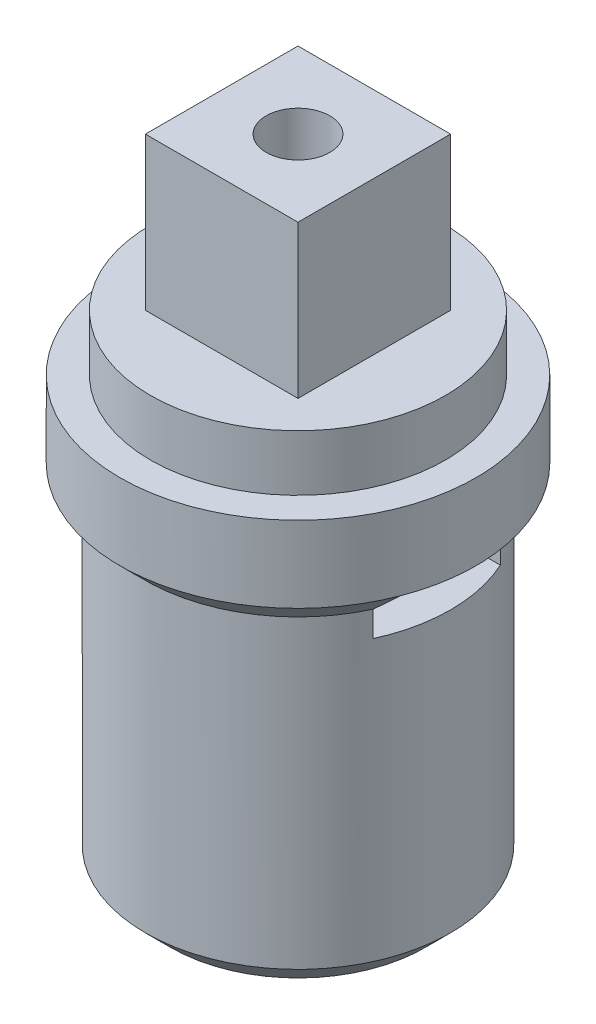
ISO-10303-21;
HEADER;
FILE_DESCRIPTION(('STEP AP214'),'2;1');
FILE_NAME('part.step','',(''),(''),'','','');
FILE_SCHEMA(('AUTOMOTIVE_DESIGN { 1 0 10303 214 1 1 1 1 }'));
ENDSEC;
DATA;
#1=APPLICATION_CONTEXT('core data for automotive mechanical design processes');
#2=APPLICATION_PROTOCOL_DEFINITION('international standard','automotive_design',2000,#1);
#3=PRODUCT_CONTEXT('',#1,'mechanical');
#4=PRODUCT('Part','Part','',(#3));
#5=PRODUCT_RELATED_PRODUCT_CATEGORY('part','',(#4));
#6=PRODUCT_DEFINITION_FORMATION('','',#4);
#7=PRODUCT_DEFINITION_CONTEXT('part definition',#1,'design');
#8=PRODUCT_DEFINITION('design','',#6,#7);
#9=PRODUCT_DEFINITION_SHAPE('','',#8);
#10=(LENGTH_UNIT() NAMED_UNIT(*) SI_UNIT(.MILLI.,.METRE.));
#11=(NAMED_UNIT(*) PLANE_ANGLE_UNIT() SI_UNIT($,.RADIAN.));
#12=(NAMED_UNIT(*) SI_UNIT($,.STERADIAN.) SOLID_ANGLE_UNIT());
#13=UNCERTAINTY_MEASURE_WITH_UNIT(LENGTH_MEASURE(1.E-05),#10,'distance_accuracy_value','');
#14=(GEOMETRIC_REPRESENTATION_CONTEXT(3) GLOBAL_UNCERTAINTY_ASSIGNED_CONTEXT((#13)) GLOBAL_UNIT_ASSIGNED_CONTEXT((#10,
#11,#12)) REPRESENTATION_CONTEXT('',''));
#15=CARTESIAN_POINT('',(0.,0.,0.));
#16=DIRECTION('',(0.,0.,1.));
#17=DIRECTION('',(1.,0.,0.));
#18=AXIS2_PLACEMENT_3D('',#15,#16,#17);
#19=CARTESIAN_POINT('',(0.,19.2,0.));
#20=DIRECTION('',(0.,1.,0.));
#21=DIRECTION('',(0.,0.,1.));
#22=AXIS2_PLACEMENT_3D('',#19,#20,#21);
#23=PLANE('',#22);
#24=CARTESIAN_POINT('',(0.,19.2,0.));
#25=DIRECTION('',(0.,1.,0.));
#26=DIRECTION('',(0.,0.,1.));
#27=AXIS2_PLACEMENT_3D('',#24,#25,#26);
#28=CIRCLE('',#27,5.8);
#29=CARTESIAN_POINT('',(0.,19.2,5.8));
#30=VERTEX_POINT('',#29);
#31=EDGE_CURVE('E173',#30,#30,#28,.T.);
#32=ORIENTED_EDGE('',*,*,#31,.T.);
#33=EDGE_LOOP('',(#32));
#34=FACE_BOUND('',#33,.T.);
#35=DIRECTION('',(-1.,0.,0.));
#36=VECTOR('',#35,1.);
#37=CARTESIAN_POINT('',(-3.,19.2,-3.));
#38=LINE('',#37,#36);
#39=CARTESIAN_POINT('',(3.,19.2,-3.));
#40=VERTEX_POINT('',#39);
#41=CARTESIAN_POINT('',(-3.,19.2,-3.));
#42=VERTEX_POINT('',#41);
#43=EDGE_CURVE('E585',#40,#42,#38,.T.);
#44=ORIENTED_EDGE('',*,*,#43,.F.);
#45=DIRECTION('',(0.,0.,-1.));
#46=VECTOR('',#45,1.);
#47=CARTESIAN_POINT('',(3.,19.2,-3.));
#48=LINE('',#47,#46);
#49=CARTESIAN_POINT('',(3.,19.2,3.));
#50=VERTEX_POINT('',#49);
#51=EDGE_CURVE('E161',#50,#40,#48,.T.);
#52=ORIENTED_EDGE('',*,*,#51,.F.);
#53=DIRECTION('',(1.,0.,0.));
#54=VECTOR('',#53,1.);
#55=CARTESIAN_POINT('',(-3.,19.2,3.));
#56=LINE('',#55,#54);
#57=CARTESIAN_POINT('',(-3.,19.2,3.));
#58=VERTEX_POINT('',#57);
#59=EDGE_CURVE('E157',#58,#50,#56,.T.);
#60=ORIENTED_EDGE('',*,*,#59,.F.);
#61=DIRECTION('',(0.,0.,1.));
#62=VECTOR('',#61,1.);
#63=CARTESIAN_POINT('',(-3.,19.2,-3.));
#64=LINE('',#63,#62);
#65=EDGE_CURVE('E582',#42,#58,#64,.T.);
#66=ORIENTED_EDGE('',*,*,#65,.F.);
#67=EDGE_LOOP('',(#44,#52,#60,#66));
#68=FACE_BOUND('',#67,.T.);
#69=ADVANCED_FACE('F36',(#34,#68),#23,.T.);
#70=CARTESIAN_POINT('',(0.,12.,0.));
#71=DIRECTION('',(0.,1.,0.));
#72=DIRECTION('',(0.,0.,1.));
#73=AXIS2_PLACEMENT_3D('',#70,#71,#72);
#74=PLANE('',#73);
#75=CARTESIAN_POINT('',(0.,12.,0.));
#76=DIRECTION('',(0.,1.,0.));
#77=DIRECTION('',(0.,0.,1.));
#78=AXIS2_PLACEMENT_3D('',#75,#76,#77);
#79=CIRCLE('',#78,1.5);
#80=CARTESIAN_POINT('',(0.,12.,1.5));
#81=VERTEX_POINT('',#80);
#82=EDGE_CURVE('E210',#81,#81,#79,.T.);
#83=ORIENTED_EDGE('',*,*,#82,.F.);
#84=EDGE_LOOP('',(#83));
#85=FACE_BOUND('',#84,.T.);
#86=CARTESIAN_POINT('',(0.,12.,0.));
#87=DIRECTION('',(0.,1.,0.));
#88=DIRECTION('',(0.,0.,1.));
#89=AXIS2_PLACEMENT_3D('',#86,#87,#88);
#90=CIRCLE('',#89,6.);
#91=CARTESIAN_POINT('',(-5.45435605731786,12.,-2.5));
#92=VERTEX_POINT('',#91);
#93=CARTESIAN_POINT('',(-5.45435605731786,12.,2.5));
#94=VERTEX_POINT('',#93);
#95=EDGE_CURVE('E219',#92,#94,#90,.T.);
#96=ORIENTED_EDGE('',*,*,#95,.T.);
#97=DIRECTION('',(-1.,0.,0.));
#98=VECTOR('',#97,1.);
#99=CARTESIAN_POINT('',(5.45435605731786,12.,2.5));
#100=LINE('',#99,#98);
#101=CARTESIAN_POINT('',(5.45435605731786,12.,2.5));
#102=VERTEX_POINT('',#101);
#103=EDGE_CURVE('E186',#102,#94,#100,.T.);
#104=ORIENTED_EDGE('',*,*,#103,.F.);
#105=CARTESIAN_POINT('',(5.45435605731786,12.,-2.5));
#106=VERTEX_POINT('',#105);
#107=EDGE_CURVE('E214',#102,#106,#90,.T.);
#108=ORIENTED_EDGE('',*,*,#107,.T.);
#109=DIRECTION('',(1.,0.,0.));
#110=VECTOR('',#109,1.);
#111=CARTESIAN_POINT('',(5.45435605731786,12.,-2.5));
#112=LINE('',#111,#110);
#113=EDGE_CURVE('E200',#92,#106,#112,.T.);
#114=ORIENTED_EDGE('',*,*,#113,.F.);
#115=EDGE_LOOP('',(#96,#104,#108,#114));
#116=FACE_BOUND('',#115,.T.);
#117=ADVANCED_FACE('F283',(#85,#116),#74,.T.);
#118=CARTESIAN_POINT('',(0.,9.,0.));
#119=DIRECTION('',(0.,-1.,0.));
#120=DIRECTION('',(0.,0.,-1.));
#121=AXIS2_PLACEMENT_3D('',#118,#119,#120);
#122=CYLINDRICAL_SURFACE('',#121,6.);
#123=CARTESIAN_POINT('',(0.,0.999999999999999,0.));
#124=DIRECTION('',(0.,1.,0.));
#125=DIRECTION('',(0.,0.,1.));
#126=AXIS2_PLACEMENT_3D('',#123,#124,#125);
#127=CIRCLE('',#126,6.);
#128=CARTESIAN_POINT('',(0.,0.999999999999999,6.));
#129=VERTEX_POINT('',#128);
#130=EDGE_CURVE('E247',#129,#129,#127,.T.);
#131=ORIENTED_EDGE('',*,*,#130,.T.);
#132=EDGE_LOOP('',(#131));
#133=FACE_BOUND('',#132,.T.);
#134=DIRECTION('',(0.,-1.,0.));
#135=VECTOR('',#134,1.);
#136=CARTESIAN_POINT('',(5.45435605731786,14.,2.5));
#137=LINE('',#136,#135);
#138=CARTESIAN_POINT('',(5.45435605731786,13.,2.5));
#139=VERTEX_POINT('',#138);
#140=EDGE_CURVE('E198',#139,#102,#137,.T.);
#141=ORIENTED_EDGE('',*,*,#140,.F.);
#142=CARTESIAN_POINT('',(0.,13.,0.));
#143=DIRECTION('',(0.,1.,0.));
#144=DIRECTION('',(0.,0.,1.));
#145=AXIS2_PLACEMENT_3D('',#142,#143,#144);
#146=CIRCLE('',#145,6.);
#147=CARTESIAN_POINT('',(-5.45435605731786,13.,2.5));
#148=VERTEX_POINT('',#147);
#149=EDGE_CURVE('E244',#139,#148,#146,.F.);
#150=ORIENTED_EDGE('',*,*,#149,.T.);
#151=DIRECTION('',(0.,-1.,0.));
#152=VECTOR('',#151,1.);
#153=CARTESIAN_POINT('',(-5.45435605731786,14.,2.5));
#154=LINE('',#153,#152);
#155=EDGE_CURVE('E193',#148,#94,#154,.T.);
#156=ORIENTED_EDGE('',*,*,#155,.T.);
#157=ORIENTED_EDGE('',*,*,#95,.F.);
#158=DIRECTION('',(0.,-1.,0.));
#159=VECTOR('',#158,1.);
#160=CARTESIAN_POINT('',(-5.45435605731786,14.,-2.5));
#161=LINE('',#160,#159);
#162=CARTESIAN_POINT('',(-5.45435605731786,13.,-2.5));
#163=VERTEX_POINT('',#162);
#164=EDGE_CURVE('E208',#163,#92,#161,.T.);
#165=ORIENTED_EDGE('',*,*,#164,.F.);
#166=CARTESIAN_POINT('',(0.,13.,0.));
#167=DIRECTION('',(0.,1.,0.));
#168=DIRECTION('',(0.,0.,1.));
#169=AXIS2_PLACEMENT_3D('',#166,#167,#168);
#170=CIRCLE('',#169,6.);
#171=CARTESIAN_POINT('',(5.45435605731786,13.,-2.5));
#172=VERTEX_POINT('',#171);
#173=EDGE_CURVE('E180',#163,#172,#170,.F.);
#174=ORIENTED_EDGE('',*,*,#173,.T.);
#175=DIRECTION('',(0.,-1.,0.));
#176=VECTOR('',#175,1.);
#177=CARTESIAN_POINT('',(5.45435605731786,14.,-2.5));
#178=LINE('',#177,#176);
#179=EDGE_CURVE('E203',#172,#106,#178,.T.);
#180=ORIENTED_EDGE('',*,*,#179,.T.);
#181=ORIENTED_EDGE('',*,*,#107,.F.);
#182=EDGE_LOOP('',(#141,#150,#156,#157,#165,#174,#180,#181));
#183=FACE_BOUND('',#182,.T.);
#184=ADVANCED_FACE('F279',(#133,#183),#122,.T.);
#185=CARTESIAN_POINT('',(0.,0.,0.));
#186=DIRECTION('',(0.,1.,0.));
#187=DIRECTION('',(0.,0.,1.));
#188=AXIS2_PLACEMENT_3D('',#185,#186,#187);
#189=PLANE('',#188);
#190=CARTESIAN_POINT('',(0.,0.,0.));
#191=DIRECTION('',(0.,1.,0.));
#192=DIRECTION('',(0.,0.,1.));
#193=AXIS2_PLACEMENT_3D('',#190,#191,#192);
#194=CIRCLE('',#193,5.);
#195=CARTESIAN_POINT('',(0.,0.,5.));
#196=VERTEX_POINT('',#195);
#197=EDGE_CURVE('E251',#196,#196,#194,.F.);
#198=ORIENTED_EDGE('',*,*,#197,.T.);
#199=EDGE_LOOP('',(#198));
#200=FACE_BOUND('',#199,.T.);
#201=DIRECTION('',(0.,0.,1.));
#202=VECTOR('',#201,1.);
#203=CARTESIAN_POINT('',(-1.28,0.,-1.40413674547745));
#204=LINE('',#203,#202);
#205=CARTESIAN_POINT('',(-1.28,0.,-1.40413674547745));
#206=VERTEX_POINT('',#205);
#207=CARTESIAN_POINT('',(-1.28,0.,1.40413674547745));
#208=VERTEX_POINT('',#207);
#209=EDGE_CURVE('E227',#206,#208,#204,.T.);
#210=ORIENTED_EDGE('',*,*,#209,.T.);
#211=CARTESIAN_POINT('',(0.,0.,0.));
#212=DIRECTION('',(0.,1.,0.));
#213=DIRECTION('',(0.,0.,1.));
#214=AXIS2_PLACEMENT_3D('',#211,#212,#213);
#215=CIRCLE('',#214,1.9);
#216=EDGE_CURVE('E223',#208,#206,#215,.T.);
#217=ORIENTED_EDGE('',*,*,#216,.T.);
#218=EDGE_LOOP('',(#210,#217));
#219=FACE_BOUND('',#218,.T.);
#220=ADVANCED_FACE('F282',(#200,#219),#189,.F.);
#221=CARTESIAN_POINT('',(0.,0.,0.));
#222=DIRECTION('',(0.,1.,0.));
#223=DIRECTION('',(0.,0.,1.));
#224=AXIS2_PLACEMENT_3D('',#221,#222,#223);
#225=CYLINDRICAL_SURFACE('',#224,1.9);
#226=CARTESIAN_POINT('',(0.,9.,0.));
#227=DIRECTION('',(0.,1.,0.));
#228=DIRECTION('',(0.,0.,1.));
#229=AXIS2_PLACEMENT_3D('',#226,#227,#228);
#230=CIRCLE('',#229,1.9);
#231=CARTESIAN_POINT('',(-1.28,9.,1.40413674547745));
#232=VERTEX_POINT('',#231);
#233=CARTESIAN_POINT('',(-1.28,9.,-1.40413674547745));
#234=VERTEX_POINT('',#233);
#235=EDGE_CURVE('E222',#232,#234,#230,.T.);
#236=ORIENTED_EDGE('',*,*,#235,.T.);
#237=DIRECTION('',(0.,1.,0.));
#238=VECTOR('',#237,1.);
#239=CARTESIAN_POINT('',(-1.28,0.,-1.40413674547745));
#240=LINE('',#239,#238);
#241=EDGE_CURVE('E231',#206,#234,#240,.T.);
#242=ORIENTED_EDGE('',*,*,#241,.F.);
#243=ORIENTED_EDGE('',*,*,#216,.F.);
#244=DIRECTION('',(0.,1.,0.));
#245=VECTOR('',#244,1.);
#246=CARTESIAN_POINT('',(-1.28,0.,1.40413674547745));
#247=LINE('',#246,#245);
#248=EDGE_CURVE('E181',#208,#232,#247,.T.);
#249=ORIENTED_EDGE('',*,*,#248,.T.);
#250=EDGE_LOOP('',(#236,#242,#243,#249));
#251=FACE_BOUND('',#250,.T.);
#252=ADVANCED_FACE('F287',(#251),#225,.F.);
#253=CARTESIAN_POINT('',(-1.28,0.,-1.40413674547745));
#254=DIRECTION('',(-1.,0.,0.));
#255=DIRECTION('',(0.,0.,1.));
#256=AXIS2_PLACEMENT_3D('',#253,#254,#255);
#257=PLANE('',#256);
#258=DIRECTION('',(0.,0.,1.));
#259=VECTOR('',#258,1.);
#260=CARTESIAN_POINT('',(-1.28,9.,-1.40413674547745));
#261=LINE('',#260,#259);
#262=CARTESIAN_POINT('',(-1.28,9.,-0.782048591840687));
#263=VERTEX_POINT('',#262);
#264=EDGE_CURVE('E228',#234,#263,#261,.T.);
#265=ORIENTED_EDGE('',*,*,#264,.T.);
#266=CARTESIAN_POINT('',(-1.28,9.,0.782048591840687));
#267=VERTEX_POINT('',#266);
#268=EDGE_CURVE('E237',#263,#267,#261,.T.);
#269=ORIENTED_EDGE('',*,*,#268,.T.);
#270=EDGE_CURVE('E234',#267,#232,#261,.T.);
#271=ORIENTED_EDGE('',*,*,#270,.T.);
#272=ORIENTED_EDGE('',*,*,#248,.F.);
#273=ORIENTED_EDGE('',*,*,#209,.F.);
#274=ORIENTED_EDGE('',*,*,#241,.T.);
#275=EDGE_LOOP('',(#265,#269,#271,#272,#273,#274));
#276=FACE_BOUND('',#275,.T.);
#277=ADVANCED_FACE('F291',(#276),#257,.F.);
#278=CARTESIAN_POINT('',(0.,9.,0.));
#279=DIRECTION('',(0.,1.,0.));
#280=DIRECTION('',(0.,0.,1.));
#281=AXIS2_PLACEMENT_3D('',#278,#279,#280);
#282=PLANE('',#281);
#283=ORIENTED_EDGE('',*,*,#270,.F.);
#284=CARTESIAN_POINT('',(0.,9.,0.));
#285=DIRECTION('',(0.,1.,0.));
#286=DIRECTION('',(0.,0.,1.));
#287=AXIS2_PLACEMENT_3D('',#284,#285,#286);
#288=CIRCLE('',#287,1.5);
#289=EDGE_CURVE('E215',#267,#263,#288,.T.);
#290=ORIENTED_EDGE('',*,*,#289,.T.);
#291=ORIENTED_EDGE('',*,*,#264,.F.);
#292=ORIENTED_EDGE('',*,*,#235,.F.);
#293=EDGE_LOOP('',(#283,#290,#291,#292));
#294=FACE_BOUND('',#293,.T.);
#295=ADVANCED_FACE('F295',(#294),#282,.F.);
#296=CARTESIAN_POINT('',(0.,9.,0.));
#297=DIRECTION('',(0.,1.,0.));
#298=DIRECTION('',(0.,0.,1.));
#299=AXIS2_PLACEMENT_3D('',#296,#297,#298);
#300=CYLINDRICAL_SURFACE('',#299,1.5);
#301=EDGE_CURVE('E211',#263,#267,#288,.T.);
#302=ORIENTED_EDGE('',*,*,#301,.F.);
#303=ORIENTED_EDGE('',*,*,#289,.F.);
#304=EDGE_LOOP('',(#302,#303));
#305=FACE_BOUND('',#304,.T.);
#306=ORIENTED_EDGE('',*,*,#82,.T.);
#307=EDGE_LOOP('',(#306));
#308=FACE_BOUND('',#307,.T.);
#309=ADVANCED_FACE('F299',(#305,#308),#300,.F.);
#310=CARTESIAN_POINT('',(0.,9.,0.));
#311=DIRECTION('',(0.,1.,0.));
#312=DIRECTION('',(0.,0.,1.));
#313=AXIS2_PLACEMENT_3D('',#310,#311,#312);
#314=PLANE('',#313);
#315=ORIENTED_EDGE('',*,*,#301,.T.);
#316=ORIENTED_EDGE('',*,*,#268,.F.);
#317=EDGE_LOOP('',(#315,#316));
#318=FACE_BOUND('',#317,.T.);
#319=ADVANCED_FACE('F306',(#318),#314,.T.);
#320=CARTESIAN_POINT('',(5.45435605731786,14.,-2.5));
#321=DIRECTION('',(0.,0.,-1.));
#322=DIRECTION('',(-1.,0.,0.));
#323=AXIS2_PLACEMENT_3D('',#320,#321,#322);
#324=PLANE('',#323);
#325=ORIENTED_EDGE('',*,*,#113,.T.);
#326=ORIENTED_EDGE('',*,*,#179,.F.);
#327=CARTESIAN_POINT('',(5.45435605731786,13.,-2.5));
#328=CARTESIAN_POINT('',(5.54529642140193,13.0826726264298,-2.5));
#329=CARTESIAN_POINT('',(5.63606039872621,13.165538919457,-2.5));
#330=CARTESIAN_POINT('',(5.81727250564772,13.3316141410082,-2.5));
#331=CARTESIAN_POINT('',(5.90772063880026,13.4148230656522,-2.5));
#332=CARTESIAN_POINT('',(6.0883398156715,13.5815405191101,-2.5));
#333=CARTESIAN_POINT('',(6.178510860064,13.6650490471943,-2.5));
#334=CARTESIAN_POINT('',(6.35860694066369,13.8323330229718,-2.5));
#335=CARTESIAN_POINT('',(6.44853197408404,13.9161084736657,-2.5));
#336=CARTESIAN_POINT('',(6.53834841531101,14.,-2.5));
#337=B_SPLINE_CURVE_WITH_KNOTS('',3,(#327,#328,#329,#330,#331,#332,#333,#334,#335,#336),
.UNSPECIFIED.,.F.,.F.,(4,2,2,2,4),(0.,0.368705511590142,0.737406859353099,1.10610730982775,
1.4748119198263),.UNSPECIFIED.);
#338=CARTESIAN_POINT('',(6.53834841531101,14.,-2.5));
#339=VERTEX_POINT('',#338);
#340=EDGE_CURVE('E11',#172,#339,#337,.T.);
#341=ORIENTED_EDGE('',*,*,#340,.T.);
#342=DIRECTION('',(1.,0.,0.));
#343=VECTOR('',#342,1.);
#344=CARTESIAN_POINT('',(5.45435605731786,14.,-2.5));
#345=LINE('',#344,#343);
#346=CARTESIAN_POINT('',(-6.53834841531101,14.,-2.5));
#347=VERTEX_POINT('',#346);
#348=EDGE_CURVE('E201',#347,#339,#345,.T.);
#349=ORIENTED_EDGE('',*,*,#348,.F.);
#350=CARTESIAN_POINT('',(-6.53834841531102,14.,-2.5));
#351=CARTESIAN_POINT('',(-6.44853197408404,13.9161084736657,-2.5));
#352=CARTESIAN_POINT('',(-6.35860694066369,13.8323330229718,-2.5));
#353=CARTESIAN_POINT('',(-6.178510860064,13.6650490471943,-2.5));
#354=CARTESIAN_POINT('',(-6.0883398156715,13.5815405191101,-2.5));
#355=CARTESIAN_POINT('',(-5.90772063880026,13.4148230656522,-2.5));
#356=CARTESIAN_POINT('',(-5.81727250564772,13.3316141410082,-2.5));
#357=CARTESIAN_POINT('',(-5.63606039872621,13.165538919457,-2.5));
#358=CARTESIAN_POINT('',(-5.54529642140193,13.0826726264298,-2.5));
#359=CARTESIAN_POINT('',(-5.45435605731786,13.,-2.5));
#360=B_SPLINE_CURVE_WITH_KNOTS('',3,(#350,#351,#352,#353,#354,#355,#356,#357,#358,#359),
.UNSPECIFIED.,.F.,.F.,(4,2,2,2,4),(0.,0.368704609998554,0.737405060473203,1.10610640823616,
1.4748119198263),.UNSPECIFIED.);
#361=EDGE_CURVE('E49',#347,#163,#360,.T.);
#362=ORIENTED_EDGE('',*,*,#361,.T.);
#363=ORIENTED_EDGE('',*,*,#164,.T.);
#364=EDGE_LOOP('',(#325,#326,#341,#349,#362,#363));
#365=FACE_BOUND('',#364,.T.);
#366=ADVANCED_FACE('F309',(#365),#324,.F.);
#367=CARTESIAN_POINT('',(5.45435605731786,14.,2.5));
#368=DIRECTION('',(0.,0.,1.));
#369=DIRECTION('',(1.,0.,0.));
#370=AXIS2_PLACEMENT_3D('',#367,#368,#369);
#371=PLANE('',#370);
#372=ORIENTED_EDGE('',*,*,#103,.T.);
#373=ORIENTED_EDGE('',*,*,#155,.F.);
#374=CARTESIAN_POINT('',(-5.45435605731786,13.,2.5));
#375=CARTESIAN_POINT('',(-5.54529642140193,13.0826726264298,2.5));
#376=CARTESIAN_POINT('',(-5.63606039872622,13.165538919457,2.5));
#377=CARTESIAN_POINT('',(-5.81727250564772,13.3316141410082,2.5));
#378=CARTESIAN_POINT('',(-5.90772063880026,13.4148230656522,2.5));
#379=CARTESIAN_POINT('',(-6.0883398156715,13.5815405191101,2.5));
#380=CARTESIAN_POINT('',(-6.178510860064,13.6650490471943,2.5));
#381=CARTESIAN_POINT('',(-6.35860694066369,13.8323330229718,2.5));
#382=CARTESIAN_POINT('',(-6.44853197408404,13.9161084736657,2.5));
#383=CARTESIAN_POINT('',(-6.53834841531102,14.,2.5));
#384=B_SPLINE_CURVE_WITH_KNOTS('',3,(#374,#375,#376,#377,#378,#379,#380,#381,#382,#383),
.UNSPECIFIED.,.F.,.F.,(4,2,2,2,4),(0.,0.368705511590141,0.737406859353099,1.10610730982775,
1.4748119198263),.UNSPECIFIED.);
#385=CARTESIAN_POINT('',(-6.53834841531101,14.,2.5));
#386=VERTEX_POINT('',#385);
#387=EDGE_CURVE('E261',#148,#386,#384,.T.);
#388=ORIENTED_EDGE('',*,*,#387,.T.);
#389=DIRECTION('',(-1.,0.,0.));
#390=VECTOR('',#389,1.);
#391=CARTESIAN_POINT('',(5.45435605731786,14.,2.5));
#392=LINE('',#391,#390);
#393=CARTESIAN_POINT('',(6.53834841531101,14.,2.5));
#394=VERTEX_POINT('',#393);
#395=EDGE_CURVE('E64',#394,#386,#392,.T.);
#396=ORIENTED_EDGE('',*,*,#395,.F.);
#397=CARTESIAN_POINT('',(6.53834841531102,14.,2.5));
#398=CARTESIAN_POINT('',(6.44853197408404,13.9161084736657,2.5));
#399=CARTESIAN_POINT('',(6.35860694066369,13.8323330229718,2.5));
#400=CARTESIAN_POINT('',(6.178510860064,13.6650490471943,2.5));
#401=CARTESIAN_POINT('',(6.0883398156715,13.5815405191101,2.5));
#402=CARTESIAN_POINT('',(5.90772063880026,13.4148230656522,2.5));
#403=CARTESIAN_POINT('',(5.81727250564772,13.3316141410082,2.5));
#404=CARTESIAN_POINT('',(5.63606039872621,13.165538919457,2.5));
#405=CARTESIAN_POINT('',(5.54529642140193,13.0826726264298,2.5));
#406=CARTESIAN_POINT('',(5.45435605731786,13.,2.5));
#407=B_SPLINE_CURVE_WITH_KNOTS('',3,(#397,#398,#399,#400,#401,#402,#403,#404,#405,#406),
.UNSPECIFIED.,.F.,.F.,(4,2,2,2,4),(0.,0.368704609998552,0.737405060473202,1.10610640823616,
1.4748119198263),.UNSPECIFIED.);
#408=EDGE_CURVE('E255',#394,#139,#407,.T.);
#409=ORIENTED_EDGE('',*,*,#408,.T.);
#410=ORIENTED_EDGE('',*,*,#140,.T.);
#411=EDGE_LOOP('',(#372,#373,#388,#396,#409,#410));
#412=FACE_BOUND('',#411,.T.);
#413=ADVANCED_FACE('F265',(#412),#371,.F.);
#414=CARTESIAN_POINT('',(0.,14.,0.));
#415=DIRECTION('',(0.,1.,0.));
#416=DIRECTION('',(0.,0.,1.));
#417=AXIS2_PLACEMENT_3D('',#414,#415,#416);
#418=PLANE('',#417);
#419=CARTESIAN_POINT('',(0.,14.,0.));
#420=DIRECTION('',(0.,1.,0.));
#421=DIRECTION('',(0.,0.,1.));
#422=AXIS2_PLACEMENT_3D('',#419,#420,#421);
#423=CIRCLE('',#422,1.3);
#424=CARTESIAN_POINT('',(0.,14.,1.3));
#425=VERTEX_POINT('',#424);
#426=EDGE_CURVE('E166',#425,#425,#423,.T.);
#427=ORIENTED_EDGE('',*,*,#426,.T.);
#428=EDGE_LOOP('',(#427));
#429=FACE_BOUND('',#428,.T.);
#430=CARTESIAN_POINT('',(0.,14.,0.));
#431=DIRECTION('',(0.,1.,0.));
#432=DIRECTION('',(0.,0.,1.));
#433=AXIS2_PLACEMENT_3D('',#430,#431,#432);
#434=CIRCLE('',#433,7.);
#435=EDGE_CURVE('E187',#394,#339,#434,.T.);
#436=ORIENTED_EDGE('',*,*,#435,.F.);
#437=ORIENTED_EDGE('',*,*,#395,.T.);
#438=EDGE_CURVE('E330',#347,#386,#434,.T.);
#439=ORIENTED_EDGE('',*,*,#438,.F.);
#440=ORIENTED_EDGE('',*,*,#348,.T.);
#441=EDGE_LOOP('',(#436,#437,#439,#440));
#442=FACE_BOUND('',#441,.T.);
#443=ADVANCED_FACE('F345',(#429,#442),#418,.F.);
#444=CARTESIAN_POINT('',(0.,17.,0.));
#445=DIRECTION('',(0.,-1.,0.));
#446=DIRECTION('',(0.,0.,-1.));
#447=AXIS2_PLACEMENT_3D('',#444,#445,#446);
#448=CYLINDRICAL_SURFACE('',#447,7.);
#449=CARTESIAN_POINT('',(0.,17.,0.));
#450=DIRECTION('',(0.,1.,0.));
#451=DIRECTION('',(0.,0.,1.));
#452=AXIS2_PLACEMENT_3D('',#449,#450,#451);
#453=CIRCLE('',#452,7.);
#454=CARTESIAN_POINT('',(0.,17.,7.));
#455=VERTEX_POINT('',#454);
#456=EDGE_CURVE('E182',#455,#455,#453,.T.);
#457=ORIENTED_EDGE('',*,*,#456,.F.);
#458=EDGE_LOOP('',(#457));
#459=FACE_BOUND('',#458,.T.);
#460=ORIENTED_EDGE('',*,*,#435,.T.);
#461=EDGE_CURVE('E190',#339,#347,#434,.T.);
#462=ORIENTED_EDGE('',*,*,#461,.T.);
#463=ORIENTED_EDGE('',*,*,#438,.T.);
#464=EDGE_CURVE('E176',#386,#394,#434,.T.);
#465=ORIENTED_EDGE('',*,*,#464,.T.);
#466=EDGE_LOOP('',(#460,#462,#463,#465));
#467=FACE_BOUND('',#466,.T.);
#468=ADVANCED_FACE('F331',(#459,#467),#448,.T.);
#469=CARTESIAN_POINT('',(0.,17.,0.));
#470=DIRECTION('',(0.,1.,0.));
#471=DIRECTION('',(0.,0.,1.));
#472=AXIS2_PLACEMENT_3D('',#469,#470,#471);
#473=PLANE('',#472);
#474=CARTESIAN_POINT('',(0.,17.,0.));
#475=DIRECTION('',(0.,1.,0.));
#476=DIRECTION('',(0.,0.,1.));
#477=AXIS2_PLACEMENT_3D('',#474,#475,#476);
#478=CIRCLE('',#477,5.8);
#479=CARTESIAN_POINT('',(0.,17.,5.8));
#480=VERTEX_POINT('',#479);
#481=EDGE_CURVE('E177',#480,#480,#478,.T.);
#482=ORIENTED_EDGE('',*,*,#481,.F.);
#483=EDGE_LOOP('',(#482));
#484=FACE_BOUND('',#483,.T.);
#485=ORIENTED_EDGE('',*,*,#456,.T.);
#486=EDGE_LOOP('',(#485));
#487=FACE_BOUND('',#486,.T.);
#488=ADVANCED_FACE('F353',(#484,#487),#473,.T.);
#489=CARTESIAN_POINT('',(0.,19.2,0.));
#490=DIRECTION('',(0.,-1.,0.));
#491=DIRECTION('',(0.,0.,-1.));
#492=AXIS2_PLACEMENT_3D('',#489,#490,#491);
#493=CYLINDRICAL_SURFACE('',#492,5.8);
#494=ORIENTED_EDGE('',*,*,#31,.F.);
#495=EDGE_LOOP('',(#494));
#496=FACE_BOUND('',#495,.T.);
#497=ORIENTED_EDGE('',*,*,#481,.T.);
#498=EDGE_LOOP('',(#497));
#499=FACE_BOUND('',#498,.T.);
#500=ADVANCED_FACE('F365',(#496,#499),#493,.T.);
#501=CARTESIAN_POINT('',(0.,13.2,0.));
#502=DIRECTION('',(0.,1.,0.));
#503=DIRECTION('',(0.,0.,1.));
#504=AXIS2_PLACEMENT_3D('',#501,#502,#503);
#505=CYLINDRICAL_SURFACE('',#504,1.3);
#506=CARTESIAN_POINT('',(0.,19.2,0.));
#507=DIRECTION('',(0.,1.,0.));
#508=DIRECTION('',(0.,0.,1.));
#509=AXIS2_PLACEMENT_3D('',#506,#507,#508);
#510=CIRCLE('',#509,1.3);
#511=CARTESIAN_POINT('',(0.,19.2,1.3));
#512=VERTEX_POINT('',#511);
#513=EDGE_CURVE('E163',#512,#512,#510,.F.);
#514=ORIENTED_EDGE('',*,*,#513,.F.);
#515=EDGE_LOOP('',(#514));
#516=FACE_BOUND('',#515,.T.);
#517=ORIENTED_EDGE('',*,*,#426,.F.);
#518=EDGE_LOOP('',(#517));
#519=FACE_BOUND('',#518,.T.);
#520=ADVANCED_FACE('F277',(#516,#519),#505,.F.);
#521=CARTESIAN_POINT('',(0.,0.999999999999999,0.));
#522=DIRECTION('',(0.,1.,0.));
#523=DIRECTION('',(0.,0.,1.));
#524=AXIS2_PLACEMENT_3D('',#521,#522,#523);
#525=CONICAL_SURFACE('',#524,6.,0.78539816339745);
#526=ORIENTED_EDGE('',*,*,#197,.F.);
#527=EDGE_LOOP('',(#526));
#528=FACE_BOUND('',#527,.T.);
#529=ORIENTED_EDGE('',*,*,#130,.F.);
#530=EDGE_LOOP('',(#529));
#531=FACE_BOUND('',#530,.T.);
#532=ADVANCED_FACE('F272',(#528,#531),#525,.T.);
#533=CARTESIAN_POINT('',(0.,14.,0.));
#534=DIRECTION('',(0.,1.,0.));
#535=DIRECTION('',(0.,0.,1.));
#536=AXIS2_PLACEMENT_3D('',#533,#534,#535);
#537=CONICAL_SURFACE('',#536,7.00000000000001,0.785398163397453);
#538=ORIENTED_EDGE('',*,*,#387,.F.);
#539=ORIENTED_EDGE('',*,*,#149,.F.);
#540=ORIENTED_EDGE('',*,*,#408,.F.);
#541=ORIENTED_EDGE('',*,*,#464,.F.);
#542=EDGE_LOOP('',(#538,#539,#540,#541));
#543=FACE_BOUND('',#542,.T.);
#544=ADVANCED_FACE('F268',(#543),#537,.T.);
#545=CARTESIAN_POINT('',(0.,14.,0.));
#546=DIRECTION('',(0.,1.,0.));
#547=DIRECTION('',(0.,0.,1.));
#548=AXIS2_PLACEMENT_3D('',#545,#546,#547);
#549=CONICAL_SURFACE('',#548,7.00000000000001,0.785398163397453);
#550=ORIENTED_EDGE('',*,*,#340,.F.);
#551=ORIENTED_EDGE('',*,*,#173,.F.);
#552=ORIENTED_EDGE('',*,*,#361,.F.);
#553=ORIENTED_EDGE('',*,*,#461,.F.);
#554=EDGE_LOOP('',(#550,#551,#552,#553));
#555=FACE_BOUND('',#554,.T.);
#556=ADVANCED_FACE('F38',(#555),#549,.T.);
#557=CARTESIAN_POINT('',(0.,19.2,0.));
#558=DIRECTION('',(0.,1.,0.));
#559=DIRECTION('',(0.,0.,1.));
#560=AXIS2_PLACEMENT_3D('',#557,#558,#559);
#561=PLANE('',#560);
#562=CARTESIAN_POINT('',(0.,19.2,0.));
#563=DIRECTION('',(0.,1.,0.));
#564=DIRECTION('',(0.,0.,1.));
#565=AXIS2_PLACEMENT_3D('',#562,#563,#564);
#566=CIRCLE('',#565,1.25);
#567=CARTESIAN_POINT('',(0.,19.2,1.25));
#568=VERTEX_POINT('',#567);
#569=EDGE_CURVE('E590',#568,#568,#566,.T.);
#570=ORIENTED_EDGE('',*,*,#569,.T.);
#571=EDGE_LOOP('',(#570));
#572=FACE_BOUND('',#571,.T.);
#573=ORIENTED_EDGE('',*,*,#513,.T.);
#574=EDGE_LOOP('',(#573));
#575=FACE_BOUND('',#574,.T.);
#576=ADVANCED_FACE('F405',(#572,#575),#561,.F.);
#577=CARTESIAN_POINT('',(3.,25.2,-3.));
#578=DIRECTION('',(-1.,0.,0.));
#579=DIRECTION('',(0.,0.,1.));
#580=AXIS2_PLACEMENT_3D('',#577,#578,#579);
#581=PLANE('',#580);
#582=ORIENTED_EDGE('',*,*,#51,.T.);
#583=DIRECTION('',(0.,-1.,0.));
#584=VECTOR('',#583,1.);
#585=CARTESIAN_POINT('',(3.,25.2,-3.));
#586=LINE('',#585,#584);
#587=CARTESIAN_POINT('',(3.,25.2,-3.));
#588=VERTEX_POINT('',#587);
#589=EDGE_CURVE('E141',#588,#40,#586,.T.);
#590=ORIENTED_EDGE('',*,*,#589,.F.);
#591=DIRECTION('',(0.,0.,-1.));
#592=VECTOR('',#591,1.);
#593=CARTESIAN_POINT('',(3.,25.2,-3.));
#594=LINE('',#593,#592);
#595=CARTESIAN_POINT('',(3.,25.2,3.));
#596=VERTEX_POINT('',#595);
#597=EDGE_CURVE('E148',#596,#588,#594,.T.);
#598=ORIENTED_EDGE('',*,*,#597,.F.);
#599=DIRECTION('',(0.,-1.,0.));
#600=VECTOR('',#599,1.);
#601=CARTESIAN_POINT('',(3.,25.2,3.));
#602=LINE('',#601,#600);
#603=EDGE_CURVE('E599',#596,#50,#602,.T.);
#604=ORIENTED_EDGE('',*,*,#603,.T.);
#605=EDGE_LOOP('',(#582,#590,#598,#604));
#606=FACE_BOUND('',#605,.T.);
#607=ADVANCED_FACE('F159',(#606),#581,.F.);
#608=CARTESIAN_POINT('',(-3.,25.2,-3.));
#609=DIRECTION('',(0.,0.,1.));
#610=DIRECTION('',(1.,0.,0.));
#611=AXIS2_PLACEMENT_3D('',#608,#609,#610);
#612=PLANE('',#611);
#613=ORIENTED_EDGE('',*,*,#43,.T.);
#614=DIRECTION('',(0.,-1.,0.));
#615=VECTOR('',#614,1.);
#616=CARTESIAN_POINT('',(-3.,25.2,-3.));
#617=LINE('',#616,#615);
#618=CARTESIAN_POINT('',(-3.,25.2,-3.));
#619=VERTEX_POINT('',#618);
#620=EDGE_CURVE('E144',#619,#42,#617,.T.);
#621=ORIENTED_EDGE('',*,*,#620,.F.);
#622=DIRECTION('',(-1.,0.,0.));
#623=VECTOR('',#622,1.);
#624=CARTESIAN_POINT('',(-3.,25.2,-3.));
#625=LINE('',#624,#623);
#626=EDGE_CURVE('E137',#588,#619,#625,.T.);
#627=ORIENTED_EDGE('',*,*,#626,.F.);
#628=ORIENTED_EDGE('',*,*,#589,.T.);
#629=EDGE_LOOP('',(#613,#621,#627,#628));
#630=FACE_BOUND('',#629,.T.);
#631=ADVANCED_FACE('F139',(#630),#612,.F.);
#632=CARTESIAN_POINT('',(-3.,25.2,-3.));
#633=DIRECTION('',(1.,0.,0.));
#634=DIRECTION('',(0.,0.,-1.));
#635=AXIS2_PLACEMENT_3D('',#632,#633,#634);
#636=PLANE('',#635);
#637=ORIENTED_EDGE('',*,*,#65,.T.);
#638=DIRECTION('',(0.,-1.,0.));
#639=VECTOR('',#638,1.);
#640=CARTESIAN_POINT('',(-3.,25.2,3.));
#641=LINE('',#640,#639);
#642=CARTESIAN_POINT('',(-3.,25.2,3.));
#643=VERTEX_POINT('',#642);
#644=EDGE_CURVE('E56',#643,#58,#641,.T.);
#645=ORIENTED_EDGE('',*,*,#644,.F.);
#646=DIRECTION('',(0.,0.,1.));
#647=VECTOR('',#646,1.);
#648=CARTESIAN_POINT('',(-3.,25.2,-3.));
#649=LINE('',#648,#647);
#650=EDGE_CURVE('E147',#619,#643,#649,.T.);
#651=ORIENTED_EDGE('',*,*,#650,.F.);
#652=ORIENTED_EDGE('',*,*,#620,.T.);
#653=EDGE_LOOP('',(#637,#645,#651,#652));
#654=FACE_BOUND('',#653,.T.);
#655=ADVANCED_FACE('F426',(#654),#636,.F.);
#656=CARTESIAN_POINT('',(-3.,25.2,3.));
#657=DIRECTION('',(0.,0.,-1.));
#658=DIRECTION('',(-1.,0.,0.));
#659=AXIS2_PLACEMENT_3D('',#656,#657,#658);
#660=PLANE('',#659);
#661=ORIENTED_EDGE('',*,*,#59,.T.);
#662=ORIENTED_EDGE('',*,*,#603,.F.);
#663=DIRECTION('',(1.,0.,0.));
#664=VECTOR('',#663,1.);
#665=CARTESIAN_POINT('',(-3.,25.2,3.));
#666=LINE('',#665,#664);
#667=EDGE_CURVE('E152',#643,#596,#666,.T.);
#668=ORIENTED_EDGE('',*,*,#667,.F.);
#669=ORIENTED_EDGE('',*,*,#644,.T.);
#670=EDGE_LOOP('',(#661,#662,#668,#669));
#671=FACE_BOUND('',#670,.T.);
#672=ADVANCED_FACE('F433',(#671),#660,.F.);
#673=CARTESIAN_POINT('',(0.,25.2,0.));
#674=DIRECTION('',(0.,1.,0.));
#675=DIRECTION('',(0.,0.,1.));
#676=AXIS2_PLACEMENT_3D('',#673,#674,#675);
#677=PLANE('',#676);
#678=CARTESIAN_POINT('',(0.,25.2,0.));
#679=DIRECTION('',(0.,1.,0.));
#680=DIRECTION('',(0.,0.,1.));
#681=AXIS2_PLACEMENT_3D('',#678,#679,#680);
#682=CIRCLE('',#681,1.25);
#683=CARTESIAN_POINT('',(0.,25.2,1.25));
#684=VERTEX_POINT('',#683);
#685=EDGE_CURVE('E587',#684,#684,#682,.T.);
#686=ORIENTED_EDGE('',*,*,#685,.F.);
#687=EDGE_LOOP('',(#686));
#688=FACE_BOUND('',#687,.T.);
#689=ORIENTED_EDGE('',*,*,#597,.T.);
#690=ORIENTED_EDGE('',*,*,#626,.T.);
#691=ORIENTED_EDGE('',*,*,#650,.T.);
#692=ORIENTED_EDGE('',*,*,#667,.T.);
#693=EDGE_LOOP('',(#689,#690,#691,#692));
#694=FACE_BOUND('',#693,.T.);
#695=ADVANCED_FACE('F151',(#688,#694),#677,.T.);
#696=CARTESIAN_POINT('',(0.,17.2,0.));
#697=DIRECTION('',(0.,1.,0.));
#698=DIRECTION('',(0.,0.,1.));
#699=AXIS2_PLACEMENT_3D('',#696,#697,#698);
#700=CYLINDRICAL_SURFACE('',#699,1.25);
#701=ORIENTED_EDGE('',*,*,#685,.T.);
#702=EDGE_LOOP('',(#701));
#703=FACE_BOUND('',#702,.T.);
#704=ORIENTED_EDGE('',*,*,#569,.F.);
#705=EDGE_LOOP('',(#704));
#706=FACE_BOUND('',#705,.T.);
#707=ADVANCED_FACE('F444',(#703,#706),#700,.F.);
#708=CLOSED_SHELL('',(#69,#117,#184,#220,#252,#277,#295,#309,#319,#366,#413,#443,#468,#488,#500,
#520,#532,#544,#556,#576,#607,#631,#655,#672,#695,#707));
#709=MANIFOLD_SOLID_BREP('B2',#708);
#710=ADVANCED_BREP_SHAPE_REPRESENTATION('',(#18,#709),#14);
#711=SHAPE_DEFINITION_REPRESENTATION(#9,#710);
ENDSEC;
END-ISO-10303-21;
